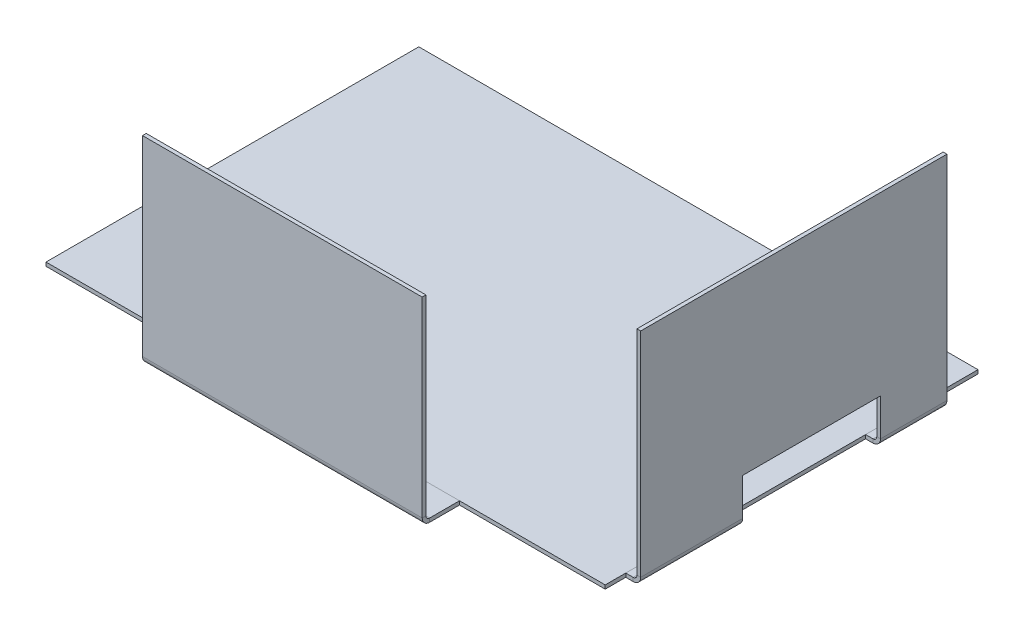
ISO-10303-21;
HEADER;
FILE_DESCRIPTION(('STEP AP214'),'2;1');
FILE_NAME('part.step','',(''),(''),'','','');
FILE_SCHEMA(('AUTOMOTIVE_DESIGN { 1 0 10303 214 1 1 1 1 }'));
ENDSEC;
DATA;
#1=APPLICATION_CONTEXT('core data for automotive mechanical design processes');
#2=APPLICATION_PROTOCOL_DEFINITION('international standard','automotive_design',2000,#1);
#3=PRODUCT_CONTEXT('',#1,'mechanical');
#4=PRODUCT('Part','Part','',(#3));
#5=PRODUCT_RELATED_PRODUCT_CATEGORY('part','',(#4));
#6=PRODUCT_DEFINITION_FORMATION('','',#4);
#7=PRODUCT_DEFINITION_CONTEXT('part definition',#1,'design');
#8=PRODUCT_DEFINITION('design','',#6,#7);
#9=PRODUCT_DEFINITION_SHAPE('','',#8);
#10=(LENGTH_UNIT() NAMED_UNIT(*) SI_UNIT(.MILLI.,.METRE.));
#11=(NAMED_UNIT(*) PLANE_ANGLE_UNIT() SI_UNIT($,.RADIAN.));
#12=(NAMED_UNIT(*) SI_UNIT($,.STERADIAN.) SOLID_ANGLE_UNIT());
#13=UNCERTAINTY_MEASURE_WITH_UNIT(LENGTH_MEASURE(1.E-05),#10,'distance_accuracy_value','');
#14=(GEOMETRIC_REPRESENTATION_CONTEXT(3) GLOBAL_UNCERTAINTY_ASSIGNED_CONTEXT((#13)) GLOBAL_UNIT_ASSIGNED_CONTEXT((#10,
#11,#12)) REPRESENTATION_CONTEXT('',''));
#15=CARTESIAN_POINT('',(0.,0.,0.));
#16=DIRECTION('',(0.,0.,1.));
#17=DIRECTION('',(1.,0.,0.));
#18=AXIS2_PLACEMENT_3D('',#15,#16,#17);
#19=CARTESIAN_POINT('',(-39.1111522381991,52.3221391573188,59.));
#20=DIRECTION('',(-1.,0.,0.));
#21=DIRECTION('',(0.,0.,1.));
#22=AXIS2_PLACEMENT_3D('',#19,#20,#21);
#23=PLANE('',#22);
#24=DIRECTION('',(0.,-1.,0.));
#25=VECTOR('',#24,1.);
#26=CARTESIAN_POINT('',(-39.1111522381991,52.3221391573188,59.));
#27=LINE('',#26,#25);
#28=CARTESIAN_POINT('',(-39.1111522381991,52.3221391573188,59.));
#29=VERTEX_POINT('',#28);
#30=CARTESIAN_POINT('',(-39.1111522381991,1.,59.));
#31=VERTEX_POINT('',#30);
#32=EDGE_CURVE('E141',#29,#31,#27,.T.);
#33=ORIENTED_EDGE('',*,*,#32,.T.);
#34=DIRECTION('',(0.,0.,1.));
#35=VECTOR('',#34,1.);
#36=CARTESIAN_POINT('',(-39.1111522381991,1.,59.));
#37=LINE('',#36,#35);
#38=CARTESIAN_POINT('',(-39.1111522381991,1.,60.));
#39=VERTEX_POINT('',#38);
#40=EDGE_CURVE('E132',#31,#39,#37,.T.);
#41=ORIENTED_EDGE('',*,*,#40,.T.);
#42=DIRECTION('',(0.,-1.,0.));
#43=VECTOR('',#42,1.);
#44=CARTESIAN_POINT('',(-39.1111522381991,52.3221391573188,60.));
#45=LINE('',#44,#43);
#46=CARTESIAN_POINT('',(-39.1111522381991,52.3221391573188,60.));
#47=VERTEX_POINT('',#46);
#48=EDGE_CURVE('E130',#47,#39,#45,.T.);
#49=ORIENTED_EDGE('',*,*,#48,.F.);
#50=DIRECTION('',(0.,0.,1.));
#51=VECTOR('',#50,1.);
#52=CARTESIAN_POINT('',(-39.1111522381991,52.3221391573188,59.));
#53=LINE('',#52,#51);
#54=EDGE_CURVE('E14',#29,#47,#53,.T.);
#55=ORIENTED_EDGE('',*,*,#54,.F.);
#56=EDGE_LOOP('',(#33,#41,#49,#55));
#57=FACE_BOUND('',#56,.T.);
#58=ADVANCED_FACE('F88',(#57),#23,.T.);
#59=CARTESIAN_POINT('',(0.,0.,59.));
#60=DIRECTION('',(0.,0.,1.));
#61=DIRECTION('',(1.,0.,0.));
#62=AXIS2_PLACEMENT_3D('',#59,#60,#61);
#63=PLANE('',#62);
#64=DIRECTION('',(-1.,0.,0.));
#65=VECTOR('',#64,1.);
#66=CARTESIAN_POINT('',(-39.1111522381991,1.,59.));
#67=LINE('',#66,#65);
#68=CARTESIAN_POINT('',(35.9143610931483,1.,59.));
#69=VERTEX_POINT('',#68);
#70=EDGE_CURVE('E154',#31,#69,#67,.F.);
#71=ORIENTED_EDGE('',*,*,#70,.F.);
#72=ORIENTED_EDGE('',*,*,#32,.F.);
#73=DIRECTION('',(-1.,0.,0.));
#74=VECTOR('',#73,1.);
#75=CARTESIAN_POINT('',(-39.1111522381991,52.3221391573188,59.));
#76=LINE('',#75,#74);
#77=CARTESIAN_POINT('',(35.9143610931483,52.3221391573188,59.));
#78=VERTEX_POINT('',#77);
#79=EDGE_CURVE('E127',#78,#29,#76,.T.);
#80=ORIENTED_EDGE('',*,*,#79,.F.);
#81=DIRECTION('',(0.,1.,0.));
#82=VECTOR('',#81,1.);
#83=CARTESIAN_POINT('',(35.9143610931483,52.3221391573188,59.));
#84=LINE('',#83,#82);
#85=EDGE_CURVE('E143',#69,#78,#84,.T.);
#86=ORIENTED_EDGE('',*,*,#85,.F.);
#87=EDGE_LOOP('',(#71,#72,#80,#86));
#88=FACE_BOUND('',#87,.T.);
#89=ADVANCED_FACE('F255',(#88),#63,.F.);
#90=CARTESIAN_POINT('',(0.,0.,60.));
#91=DIRECTION('',(0.,0.,1.));
#92=DIRECTION('',(1.,0.,0.));
#93=AXIS2_PLACEMENT_3D('',#90,#91,#92);
#94=PLANE('',#93);
#95=ORIENTED_EDGE('',*,*,#48,.T.);
#96=DIRECTION('',(-1.,0.,0.));
#97=VECTOR('',#96,1.);
#98=CARTESIAN_POINT('',(-39.1111522381991,1.,60.));
#99=LINE('',#98,#97);
#100=CARTESIAN_POINT('',(35.9143610931483,1.,60.));
#101=VERTEX_POINT('',#100);
#102=EDGE_CURVE('E164',#39,#101,#99,.F.);
#103=ORIENTED_EDGE('',*,*,#102,.T.);
#104=DIRECTION('',(0.,1.,0.));
#105=VECTOR('',#104,1.);
#106=CARTESIAN_POINT('',(35.9143610931483,52.3221391573188,60.));
#107=LINE('',#106,#105);
#108=CARTESIAN_POINT('',(35.9143610931483,52.3221391573188,60.));
#109=VERTEX_POINT('',#108);
#110=EDGE_CURVE('E135',#101,#109,#107,.T.);
#111=ORIENTED_EDGE('',*,*,#110,.T.);
#112=DIRECTION('',(-1.,0.,0.));
#113=VECTOR('',#112,1.);
#114=CARTESIAN_POINT('',(-39.1111522381991,52.3221391573188,60.));
#115=LINE('',#114,#113);
#116=EDGE_CURVE('E125',#109,#47,#115,.T.);
#117=ORIENTED_EDGE('',*,*,#116,.T.);
#118=EDGE_LOOP('',(#95,#103,#111,#117));
#119=FACE_BOUND('',#118,.T.);
#120=ADVANCED_FACE('F138',(#119),#94,.T.);
#121=CARTESIAN_POINT('',(-39.1111522381991,52.3221391573188,59.));
#122=DIRECTION('',(0.,1.,0.));
#123=DIRECTION('',(0.,0.,1.));
#124=AXIS2_PLACEMENT_3D('',#121,#122,#123);
#125=PLANE('',#124);
#126=ORIENTED_EDGE('',*,*,#116,.F.);
#127=DIRECTION('',(0.,0.,1.));
#128=VECTOR('',#127,1.);
#129=CARTESIAN_POINT('',(35.9143610931483,52.3221391573188,59.));
#130=LINE('',#129,#128);
#131=EDGE_CURVE('E91',#78,#109,#130,.T.);
#132=ORIENTED_EDGE('',*,*,#131,.F.);
#133=ORIENTED_EDGE('',*,*,#79,.T.);
#134=ORIENTED_EDGE('',*,*,#54,.T.);
#135=EDGE_LOOP('',(#126,#132,#133,#134));
#136=FACE_BOUND('',#135,.T.);
#137=ADVANCED_FACE('F122',(#136),#125,.T.);
#138=CARTESIAN_POINT('',(35.9143610931483,52.3221391573188,59.));
#139=DIRECTION('',(1.,0.,0.));
#140=DIRECTION('',(0.,0.,-1.));
#141=AXIS2_PLACEMENT_3D('',#138,#139,#140);
#142=PLANE('',#141);
#143=DIRECTION('',(0.,0.,1.));
#144=VECTOR('',#143,1.);
#145=CARTESIAN_POINT('',(35.9143610931483,1.,59.));
#146=LINE('',#145,#144);
#147=EDGE_CURVE('E136',#69,#101,#146,.T.);
#148=ORIENTED_EDGE('',*,*,#147,.F.);
#149=ORIENTED_EDGE('',*,*,#85,.T.);
#150=ORIENTED_EDGE('',*,*,#131,.T.);
#151=ORIENTED_EDGE('',*,*,#110,.F.);
#152=EDGE_LOOP('',(#148,#149,#150,#151));
#153=FACE_BOUND('',#152,.T.);
#154=ADVANCED_FACE('F253',(#153),#142,.T.);
#155=CARTESIAN_POINT('',(35.9143610931483,1.,58.));
#156=DIRECTION('',(1.,0.,0.));
#157=DIRECTION('',(0.,0.,-1.));
#158=AXIS2_PLACEMENT_3D('',#155,#156,#157);
#159=PLANE('',#158);
#160=DIRECTION('',(0.,-1.,0.));
#161=VECTOR('',#160,1.);
#162=CARTESIAN_POINT('',(35.9143610931483,0.,58.));
#163=LINE('',#162,#161);
#164=CARTESIAN_POINT('',(35.9143610931483,0.,58.));
#165=VERTEX_POINT('',#164);
#166=CARTESIAN_POINT('',(35.9143610931483,-0.999999999999999,58.));
#167=VERTEX_POINT('',#166);
#168=EDGE_CURVE('E193',#165,#167,#163,.T.);
#169=ORIENTED_EDGE('',*,*,#168,.F.);
#170=CARTESIAN_POINT('',(35.9143610931483,1.,58.));
#171=DIRECTION('',(-1.,0.,0.));
#172=DIRECTION('',(0.,0.,1.));
#173=AXIS2_PLACEMENT_3D('',#170,#171,#172);
#174=CIRCLE('',#173,0.999999999999999);
#175=EDGE_CURVE('E158',#69,#165,#174,.F.);
#176=ORIENTED_EDGE('',*,*,#175,.F.);
#177=ORIENTED_EDGE('',*,*,#147,.T.);
#178=CARTESIAN_POINT('',(35.9143610931483,1.,58.));
#179=DIRECTION('',(-1.,0.,0.));
#180=DIRECTION('',(0.,0.,1.));
#181=AXIS2_PLACEMENT_3D('',#178,#179,#180);
#182=CIRCLE('',#181,2.);
#183=EDGE_CURVE('E102',#101,#167,#182,.F.);
#184=ORIENTED_EDGE('',*,*,#183,.T.);
#185=EDGE_LOOP('',(#169,#176,#177,#184));
#186=FACE_BOUND('',#185,.T.);
#187=ADVANCED_FACE('F249',(#186),#159,.T.);
#188=CARTESIAN_POINT('',(-39.1111522381991,1.,58.));
#189=DIRECTION('',(1.,0.,0.));
#190=DIRECTION('',(0.,0.,-1.));
#191=AXIS2_PLACEMENT_3D('',#188,#189,#190);
#192=PLANE('',#191);
#193=CARTESIAN_POINT('',(-39.1111522381991,1.,58.));
#194=DIRECTION('',(-1.,0.,0.));
#195=DIRECTION('',(0.,0.,1.));
#196=AXIS2_PLACEMENT_3D('',#193,#194,#195);
#197=CIRCLE('',#196,0.999999999999999);
#198=CARTESIAN_POINT('',(-39.1111522381991,0.,58.));
#199=VERTEX_POINT('',#198);
#200=EDGE_CURVE('E151',#199,#31,#197,.T.);
#201=ORIENTED_EDGE('',*,*,#200,.F.);
#202=DIRECTION('',(0.,-1.,0.));
#203=VECTOR('',#202,1.);
#204=CARTESIAN_POINT('',(-39.1111522381991,0.,58.));
#205=LINE('',#204,#203);
#206=CARTESIAN_POINT('',(-39.1111522381991,-0.999999999999999,58.));
#207=VERTEX_POINT('',#206);
#208=EDGE_CURVE('E192',#199,#207,#205,.T.);
#209=ORIENTED_EDGE('',*,*,#208,.T.);
#210=CARTESIAN_POINT('',(-39.1111522381991,1.,58.));
#211=DIRECTION('',(-1.,0.,0.));
#212=DIRECTION('',(0.,0.,1.));
#213=AXIS2_PLACEMENT_3D('',#210,#211,#212);
#214=CIRCLE('',#213,2.);
#215=EDGE_CURVE('E161',#207,#39,#214,.T.);
#216=ORIENTED_EDGE('',*,*,#215,.T.);
#217=ORIENTED_EDGE('',*,*,#40,.F.);
#218=EDGE_LOOP('',(#201,#209,#216,#217));
#219=FACE_BOUND('',#218,.T.);
#220=ADVANCED_FACE('F214',(#219),#192,.F.);
#221=CARTESIAN_POINT('',(-39.1111522381991,1.,58.));
#222=DIRECTION('',(-1.,0.,0.));
#223=DIRECTION('',(0.,-1.,0.));
#224=AXIS2_PLACEMENT_3D('',#221,#222,#223);
#225=CYLINDRICAL_SURFACE('',#224,2.);
#226=ORIENTED_EDGE('',*,*,#102,.F.);
#227=ORIENTED_EDGE('',*,*,#215,.F.);
#228=DIRECTION('',(1.,0.,0.));
#229=VECTOR('',#228,1.);
#230=CARTESIAN_POINT('',(0.,-0.999999999999999,58.));
#231=LINE('',#230,#229);
#232=EDGE_CURVE('E183',#207,#167,#231,.T.);
#233=ORIENTED_EDGE('',*,*,#232,.T.);
#234=ORIENTED_EDGE('',*,*,#183,.F.);
#235=EDGE_LOOP('',(#226,#227,#233,#234));
#236=FACE_BOUND('',#235,.T.);
#237=ADVANCED_FACE('F274',(#236),#225,.T.);
#238=CARTESIAN_POINT('',(-39.1111522381991,1.,58.));
#239=DIRECTION('',(-1.,0.,0.));
#240=DIRECTION('',(0.,-1.,0.));
#241=AXIS2_PLACEMENT_3D('',#238,#239,#240);
#242=CYLINDRICAL_SURFACE('',#241,0.999999999999999);
#243=ORIENTED_EDGE('',*,*,#70,.T.);
#244=ORIENTED_EDGE('',*,*,#175,.T.);
#245=DIRECTION('',(-1.,0.,0.));
#246=VECTOR('',#245,1.);
#247=CARTESIAN_POINT('',(35.9143610931483,0.,58.));
#248=LINE('',#247,#246);
#249=EDGE_CURVE('E196',#165,#199,#248,.T.);
#250=ORIENTED_EDGE('',*,*,#249,.T.);
#251=ORIENTED_EDGE('',*,*,#200,.T.);
#252=EDGE_LOOP('',(#243,#244,#250,#251));
#253=FACE_BOUND('',#252,.T.);
#254=ADVANCED_FACE('F204',(#253),#242,.F.);
#255=CARTESIAN_POINT('',(-39.1111522381991,-1.00000000000003,50.));
#256=DIRECTION('',(1.,0.,0.));
#257=DIRECTION('',(0.,0.,-1.));
#258=AXIS2_PLACEMENT_3D('',#255,#256,#257);
#259=PLANE('',#258);
#260=ORIENTED_EDGE('',*,*,#208,.F.);
#261=DIRECTION('',(0.,0.,-1.));
#262=VECTOR('',#261,1.);
#263=CARTESIAN_POINT('',(-39.1111522381991,0.,50.));
#264=LINE('',#263,#262);
#265=CARTESIAN_POINT('',(-39.1111522381991,0.,50.));
#266=VERTEX_POINT('',#265);
#267=EDGE_CURVE('E180',#199,#266,#264,.T.);
#268=ORIENTED_EDGE('',*,*,#267,.T.);
#269=DIRECTION('',(0.,1.,0.));
#270=VECTOR('',#269,1.);
#271=CARTESIAN_POINT('',(-39.1111522381991,-1.00000000000003,50.));
#272=LINE('',#271,#270);
#273=CARTESIAN_POINT('',(-39.1111522381991,-1.00000000000003,50.));
#274=VERTEX_POINT('',#273);
#275=EDGE_CURVE('E155',#274,#266,#272,.T.);
#276=ORIENTED_EDGE('',*,*,#275,.F.);
#277=DIRECTION('',(0.,0.,-1.));
#278=VECTOR('',#277,1.);
#279=CARTESIAN_POINT('',(-39.1111522381991,-1.00000000000003,50.));
#280=LINE('',#279,#278);
#281=EDGE_CURVE('E176',#207,#274,#280,.T.);
#282=ORIENTED_EDGE('',*,*,#281,.F.);
#283=EDGE_LOOP('',(#260,#268,#276,#282));
#284=FACE_BOUND('',#283,.T.);
#285=ADVANCED_FACE('F219',(#284),#259,.F.);
#286=CARTESIAN_POINT('',(35.9143610931483,-0.999999999999995,59.));
#287=DIRECTION('',(-1.,0.,0.));
#288=DIRECTION('',(0.,0.,1.));
#289=AXIS2_PLACEMENT_3D('',#286,#287,#288);
#290=PLANE('',#289);
#291=ORIENTED_EDGE('',*,*,#168,.T.);
#292=DIRECTION('',(0.,0.,1.));
#293=VECTOR('',#292,1.);
#294=CARTESIAN_POINT('',(35.9143610931483,-0.999999999999995,59.));
#295=LINE('',#294,#293);
#296=CARTESIAN_POINT('',(35.9143610931483,-1.00000000000003,50.));
#297=VERTEX_POINT('',#296);
#298=EDGE_CURVE('E172',#297,#167,#295,.T.);
#299=ORIENTED_EDGE('',*,*,#298,.F.);
#300=DIRECTION('',(0.,1.,0.));
#301=VECTOR('',#300,1.);
#302=CARTESIAN_POINT('',(35.9143610931483,-1.00000000000003,50.));
#303=LINE('',#302,#301);
#304=CARTESIAN_POINT('',(35.9143610931483,0.,50.));
#305=VERTEX_POINT('',#304);
#306=EDGE_CURVE('E169',#297,#305,#303,.T.);
#307=ORIENTED_EDGE('',*,*,#306,.T.);
#308=DIRECTION('',(0.,0.,1.));
#309=VECTOR('',#308,1.);
#310=CARTESIAN_POINT('',(35.9143610931483,0.,59.));
#311=LINE('',#310,#309);
#312=EDGE_CURVE('E173',#305,#165,#311,.T.);
#313=ORIENTED_EDGE('',*,*,#312,.T.);
#314=EDGE_LOOP('',(#291,#299,#307,#313));
#315=FACE_BOUND('',#314,.T.);
#316=ADVANCED_FACE('F235',(#315),#290,.F.);
#317=CARTESIAN_POINT('',(0.,-1.0000000000002,0.));
#318=DIRECTION('',(0.,1.,0.));
#319=DIRECTION('',(0.,0.,1.));
#320=AXIS2_PLACEMENT_3D('',#317,#318,#319);
#321=PLANE('',#320);
#322=ORIENTED_EDGE('',*,*,#232,.F.);
#323=ORIENTED_EDGE('',*,*,#281,.T.);
#324=DIRECTION('',(1.,0.,0.));
#325=VECTOR('',#324,1.);
#326=CARTESIAN_POINT('',(35.9143610931483,-1.00000000000003,50.));
#327=LINE('',#326,#325);
#328=EDGE_CURVE('E186',#274,#297,#327,.T.);
#329=ORIENTED_EDGE('',*,*,#328,.T.);
#330=ORIENTED_EDGE('',*,*,#298,.T.);
#331=EDGE_LOOP('',(#322,#323,#329,#330));
#332=FACE_BOUND('',#331,.T.);
#333=ADVANCED_FACE('F240',(#332),#321,.F.);
#334=CARTESIAN_POINT('',(0.,-2.01226909432809E-13,0.));
#335=DIRECTION('',(0.,1.,0.));
#336=DIRECTION('',(0.,0.,1.));
#337=AXIS2_PLACEMENT_3D('',#334,#335,#336);
#338=PLANE('',#337);
#339=ORIENTED_EDGE('',*,*,#267,.F.);
#340=ORIENTED_EDGE('',*,*,#249,.F.);
#341=ORIENTED_EDGE('',*,*,#312,.F.);
#342=DIRECTION('',(1.,0.,0.));
#343=VECTOR('',#342,1.);
#344=CARTESIAN_POINT('',(35.9143610931483,0.,50.));
#345=LINE('',#344,#343);
#346=EDGE_CURVE('E177',#266,#305,#345,.T.);
#347=ORIENTED_EDGE('',*,*,#346,.F.);
#348=EDGE_LOOP('',(#339,#340,#341,#347));
#349=FACE_BOUND('',#348,.T.);
#350=ADVANCED_FACE('F223',(#349),#338,.T.);
#351=CARTESIAN_POINT('',(35.9143610931483,-1.00000000000003,50.));
#352=DIRECTION('',(0.,0.,1.));
#353=DIRECTION('',(0.,-1.,0.));
#354=AXIS2_PLACEMENT_3D('',#351,#352,#353);
#355=PLANE('',#354);
#356=ORIENTED_EDGE('',*,*,#346,.T.);
#357=ORIENTED_EDGE('',*,*,#306,.F.);
#358=ORIENTED_EDGE('',*,*,#328,.F.);
#359=ORIENTED_EDGE('',*,*,#275,.T.);
#360=EDGE_LOOP('',(#356,#357,#358,#359));
#361=FACE_BOUND('',#360,.T.);
#362=ADVANCED_FACE('F228',(#361),#355,.F.);
#363=CLOSED_SHELL('',(#58,#89,#120,#137,#154,#187,#220,#237,#254,#285,#316,#333,#350,#362));
#364=MANIFOLD_SOLID_BREP('B2',#363);
#365=CARTESIAN_POINT('',(78.,10.9986856522136,-19.8482134290394));
#366=DIRECTION('',(0.,0.,-1.));
#367=DIRECTION('',(0.,-1.,0.));
#368=AXIS2_PLACEMENT_3D('',#365,#366,#367);
#369=PLANE('',#368);
#370=DIRECTION('',(-1.,0.,0.));
#371=VECTOR('',#370,1.);
#372=CARTESIAN_POINT('',(78.,1.,-19.8482134290394));
#373=LINE('',#372,#371);
#374=CARTESIAN_POINT('',(79.,1.,-19.8482134290394));
#375=VERTEX_POINT('',#374);
#376=CARTESIAN_POINT('',(78.,1.,-19.8482134290394));
#377=VERTEX_POINT('',#376);
#378=EDGE_CURVE('E419',#375,#377,#373,.T.);
#379=ORIENTED_EDGE('',*,*,#378,.F.);
#380=DIRECTION('',(0.,1.,0.));
#381=VECTOR('',#380,1.);
#382=CARTESIAN_POINT('',(79.,0.,-19.8482134290394));
#383=LINE('',#382,#381);
#384=CARTESIAN_POINT('',(79.,10.9986856522136,-19.8482134290394));
#385=VERTEX_POINT('',#384);
#386=EDGE_CURVE('E495',#385,#375,#383,.F.);
#387=ORIENTED_EDGE('',*,*,#386,.F.);
#388=DIRECTION('',(-1.,0.,0.));
#389=VECTOR('',#388,1.);
#390=CARTESIAN_POINT('',(78.,10.9986856522136,-19.8482134290394));
#391=LINE('',#390,#389);
#392=CARTESIAN_POINT('',(78.,10.9986856522136,-19.8482134290394));
#393=VERTEX_POINT('',#392);
#394=EDGE_CURVE('E489',#385,#393,#391,.T.);
#395=ORIENTED_EDGE('',*,*,#394,.T.);
#396=DIRECTION('',(0.,-1.,0.));
#397=VECTOR('',#396,1.);
#398=CARTESIAN_POINT('',(78.,10.9986856522136,-19.8482134290394));
#399=LINE('',#398,#397);
#400=EDGE_CURVE('E493',#393,#377,#399,.T.);
#401=ORIENTED_EDGE('',*,*,#400,.T.);
#402=EDGE_LOOP('',(#379,#387,#395,#401));
#403=FACE_BOUND('',#402,.T.);
#404=ADVANCED_FACE('F409',(#403),#369,.F.);
#405=CARTESIAN_POINT('',(78.,10.9986856522136,17.1097125478177));
#406=DIRECTION('',(0.,1.,0.));
#407=DIRECTION('',(0.,0.,-1.));
#408=AXIS2_PLACEMENT_3D('',#405,#406,#407);
#409=PLANE('',#408);
#410=ORIENTED_EDGE('',*,*,#394,.F.);
#411=DIRECTION('',(0.,0.,1.));
#412=VECTOR('',#411,1.);
#413=CARTESIAN_POINT('',(79.,10.9986856522136,0.));
#414=LINE('',#413,#412);
#415=CARTESIAN_POINT('',(79.,10.9986856522136,17.1097125478177));
#416=VERTEX_POINT('',#415);
#417=EDGE_CURVE('E537',#416,#385,#414,.F.);
#418=ORIENTED_EDGE('',*,*,#417,.F.);
#419=DIRECTION('',(-1.,0.,0.));
#420=VECTOR('',#419,1.);
#421=CARTESIAN_POINT('',(78.,10.9986856522136,17.1097125478177));
#422=LINE('',#421,#420);
#423=CARTESIAN_POINT('',(78.,10.9986856522136,17.1097125478177));
#424=VERTEX_POINT('',#423);
#425=EDGE_CURVE('E500',#416,#424,#422,.T.);
#426=ORIENTED_EDGE('',*,*,#425,.T.);
#427=DIRECTION('',(0.,0.,-1.));
#428=VECTOR('',#427,1.);
#429=CARTESIAN_POINT('',(78.,10.9986856522136,17.1097125478177));
#430=LINE('',#429,#428);
#431=EDGE_CURVE('E508',#424,#393,#430,.T.);
#432=ORIENTED_EDGE('',*,*,#431,.T.);
#433=EDGE_LOOP('',(#410,#418,#426,#432));
#434=FACE_BOUND('',#433,.T.);
#435=ADVANCED_FACE('F514',(#434),#409,.F.);
#436=CARTESIAN_POINT('',(78.,1.,17.1097125478177));
#437=DIRECTION('',(0.,0.,1.));
#438=DIRECTION('',(0.,1.,0.));
#439=AXIS2_PLACEMENT_3D('',#436,#437,#438);
#440=PLANE('',#439);
#441=ORIENTED_EDGE('',*,*,#425,.F.);
#442=DIRECTION('',(0.,1.,0.));
#443=VECTOR('',#442,1.);
#444=CARTESIAN_POINT('',(79.,0.,17.1097125478177));
#445=LINE('',#444,#443);
#446=CARTESIAN_POINT('',(79.,1.,17.1097125478177));
#447=VERTEX_POINT('',#446);
#448=EDGE_CURVE('E534',#447,#416,#445,.T.);
#449=ORIENTED_EDGE('',*,*,#448,.F.);
#450=DIRECTION('',(-1.,0.,0.));
#451=VECTOR('',#450,1.);
#452=CARTESIAN_POINT('',(78.,1.,17.1097125478177));
#453=LINE('',#452,#451);
#454=CARTESIAN_POINT('',(78.,1.,17.1097125478177));
#455=VERTEX_POINT('',#454);
#456=EDGE_CURVE('E547',#447,#455,#453,.T.);
#457=ORIENTED_EDGE('',*,*,#456,.T.);
#458=DIRECTION('',(0.,1.,0.));
#459=VECTOR('',#458,1.);
#460=CARTESIAN_POINT('',(78.,1.,17.1097125478177));
#461=LINE('',#460,#459);
#462=EDGE_CURVE('E515',#455,#424,#461,.T.);
#463=ORIENTED_EDGE('',*,*,#462,.T.);
#464=EDGE_LOOP('',(#441,#449,#457,#463));
#465=FACE_BOUND('',#464,.T.);
#466=ADVANCED_FACE('F683',(#465),#440,.F.);
#467=CARTESIAN_POINT('',(78.,58.2335739107928,44.4859608868171));
#468=DIRECTION('',(0.,0.,-1.));
#469=DIRECTION('',(0.,-1.,0.));
#470=AXIS2_PLACEMENT_3D('',#467,#468,#469);
#471=PLANE('',#470);
#472=DIRECTION('',(-1.,0.,0.));
#473=VECTOR('',#472,1.);
#474=CARTESIAN_POINT('',(78.,1.,44.4859608868171));
#475=LINE('',#474,#473);
#476=CARTESIAN_POINT('',(79.,1.,44.4859608868171));
#477=VERTEX_POINT('',#476);
#478=CARTESIAN_POINT('',(78.,1.,44.4859608868171));
#479=VERTEX_POINT('',#478);
#480=EDGE_CURVE('E545',#477,#479,#475,.T.);
#481=ORIENTED_EDGE('',*,*,#480,.F.);
#482=DIRECTION('',(0.,1.,0.));
#483=VECTOR('',#482,1.);
#484=CARTESIAN_POINT('',(79.,0.,44.4859608868171));
#485=LINE('',#484,#483);
#486=CARTESIAN_POINT('',(79.,58.2335739107928,44.4859608868171));
#487=VERTEX_POINT('',#486);
#488=EDGE_CURVE('E529',#487,#477,#485,.F.);
#489=ORIENTED_EDGE('',*,*,#488,.F.);
#490=DIRECTION('',(-1.,0.,0.));
#491=VECTOR('',#490,1.);
#492=CARTESIAN_POINT('',(78.,58.2335739107928,44.4859608868171));
#493=LINE('',#492,#491);
#494=CARTESIAN_POINT('',(78.,58.2335739107928,44.4859608868171));
#495=VERTEX_POINT('',#494);
#496=EDGE_CURVE('E427',#487,#495,#493,.T.);
#497=ORIENTED_EDGE('',*,*,#496,.T.);
#498=DIRECTION('',(0.,-1.,0.));
#499=VECTOR('',#498,1.);
#500=CARTESIAN_POINT('',(78.,58.2335739107928,44.4859608868171));
#501=LINE('',#500,#499);
#502=EDGE_CURVE('E522',#495,#479,#501,.T.);
#503=ORIENTED_EDGE('',*,*,#502,.T.);
#504=EDGE_LOOP('',(#481,#489,#497,#503));
#505=FACE_BOUND('',#504,.T.);
#506=ADVANCED_FACE('F687',(#505),#471,.F.);
#507=CARTESIAN_POINT('',(78.,58.2335739107928,44.4859608868171));
#508=DIRECTION('',(0.,1.,0.));
#509=DIRECTION('',(0.,0.,-1.));
#510=AXIS2_PLACEMENT_3D('',#507,#508,#509);
#511=PLANE('',#510);
#512=ORIENTED_EDGE('',*,*,#496,.F.);
#513=DIRECTION('',(0.,0.,1.));
#514=VECTOR('',#513,1.);
#515=CARTESIAN_POINT('',(79.,58.2335739107928,0.));
#516=LINE('',#515,#514);
#517=CARTESIAN_POINT('',(79.,58.2335739107928,-37.6507989938659));
#518=VERTEX_POINT('',#517);
#519=EDGE_CURVE('E524',#487,#518,#516,.F.);
#520=ORIENTED_EDGE('',*,*,#519,.T.);
#521=DIRECTION('',(-1.,0.,0.));
#522=VECTOR('',#521,1.);
#523=CARTESIAN_POINT('',(78.,58.2335739107928,-37.6507989938659));
#524=LINE('',#523,#522);
#525=CARTESIAN_POINT('',(78.,58.2335739107928,-37.6507989938659));
#526=VERTEX_POINT('',#525);
#527=EDGE_CURVE('E413',#518,#526,#524,.T.);
#528=ORIENTED_EDGE('',*,*,#527,.T.);
#529=DIRECTION('',(0.,0.,-1.));
#530=VECTOR('',#529,1.);
#531=CARTESIAN_POINT('',(78.,58.2335739107928,44.4859608868171));
#532=LINE('',#531,#530);
#533=EDGE_CURVE('E532',#495,#526,#532,.T.);
#534=ORIENTED_EDGE('',*,*,#533,.F.);
#535=EDGE_LOOP('',(#512,#520,#528,#534));
#536=FACE_BOUND('',#535,.T.);
#537=ADVANCED_FACE('F711',(#536),#511,.T.);
#538=CARTESIAN_POINT('',(78.,58.2335739107928,-37.6507989938659));
#539=DIRECTION('',(0.,0.,-1.));
#540=DIRECTION('',(0.,-1.,0.));
#541=AXIS2_PLACEMENT_3D('',#538,#539,#540);
#542=PLANE('',#541);
#543=DIRECTION('',(0.,1.,0.));
#544=VECTOR('',#543,1.);
#545=CARTESIAN_POINT('',(79.,0.,-37.6507989938659));
#546=LINE('',#545,#544);
#547=CARTESIAN_POINT('',(79.,1.,-37.6507989938659));
#548=VERTEX_POINT('',#547);
#549=EDGE_CURVE('E527',#518,#548,#546,.F.);
#550=ORIENTED_EDGE('',*,*,#549,.T.);
#551=DIRECTION('',(-1.,0.,0.));
#552=VECTOR('',#551,1.);
#553=CARTESIAN_POINT('',(78.,1.,-37.6507989938659));
#554=LINE('',#553,#552);
#555=CARTESIAN_POINT('',(78.,1.,-37.6507989938659));
#556=VERTEX_POINT('',#555);
#557=EDGE_CURVE('E86',#548,#556,#554,.T.);
#558=ORIENTED_EDGE('',*,*,#557,.T.);
#559=DIRECTION('',(0.,-1.,0.));
#560=VECTOR('',#559,1.);
#561=CARTESIAN_POINT('',(78.,58.2335739107928,-37.6507989938659));
#562=LINE('',#561,#560);
#563=EDGE_CURVE('E627',#526,#556,#562,.T.);
#564=ORIENTED_EDGE('',*,*,#563,.F.);
#565=ORIENTED_EDGE('',*,*,#527,.F.);
#566=EDGE_LOOP('',(#550,#558,#564,#565));
#567=FACE_BOUND('',#566,.T.);
#568=ADVANCED_FACE('F411',(#567),#542,.T.);
#569=CARTESIAN_POINT('',(78.,0.,0.));
#570=DIRECTION('',(-1.,0.,0.));
#571=DIRECTION('',(0.,0.,1.));
#572=AXIS2_PLACEMENT_3D('',#569,#570,#571);
#573=PLANE('',#572);
#574=ORIENTED_EDGE('',*,*,#533,.T.);
#575=ORIENTED_EDGE('',*,*,#563,.T.);
#576=DIRECTION('',(0.,0.,-1.));
#577=VECTOR('',#576,1.);
#578=CARTESIAN_POINT('',(78.,1.,-19.8482134290394));
#579=LINE('',#578,#577);
#580=EDGE_CURVE('E512',#377,#556,#579,.T.);
#581=ORIENTED_EDGE('',*,*,#580,.F.);
#582=ORIENTED_EDGE('',*,*,#400,.F.);
#583=ORIENTED_EDGE('',*,*,#431,.F.);
#584=ORIENTED_EDGE('',*,*,#462,.F.);
#585=DIRECTION('',(0.,0.,-1.));
#586=VECTOR('',#585,1.);
#587=CARTESIAN_POINT('',(78.,1.,44.4859608868171));
#588=LINE('',#587,#586);
#589=EDGE_CURVE('E517',#479,#455,#588,.T.);
#590=ORIENTED_EDGE('',*,*,#589,.F.);
#591=ORIENTED_EDGE('',*,*,#502,.F.);
#592=EDGE_LOOP('',(#574,#575,#581,#582,#583,#584,#590,#591));
#593=FACE_BOUND('',#592,.T.);
#594=ADVANCED_FACE('F506',(#593),#573,.T.);
#595=CARTESIAN_POINT('',(79.,0.,0.));
#596=DIRECTION('',(-1.,0.,0.));
#597=DIRECTION('',(0.,0.,1.));
#598=AXIS2_PLACEMENT_3D('',#595,#596,#597);
#599=PLANE('',#598);
#600=ORIENTED_EDGE('',*,*,#519,.F.);
#601=ORIENTED_EDGE('',*,*,#488,.T.);
#602=DIRECTION('',(0.,0.,1.));
#603=VECTOR('',#602,1.);
#604=CARTESIAN_POINT('',(79.,1.,0.));
#605=LINE('',#604,#603);
#606=EDGE_CURVE('E466',#477,#447,#605,.F.);
#607=ORIENTED_EDGE('',*,*,#606,.T.);
#608=ORIENTED_EDGE('',*,*,#448,.T.);
#609=ORIENTED_EDGE('',*,*,#417,.T.);
#610=ORIENTED_EDGE('',*,*,#386,.T.);
#611=DIRECTION('',(0.,0.,1.));
#612=VECTOR('',#611,1.);
#613=CARTESIAN_POINT('',(79.,1.,0.));
#614=LINE('',#613,#612);
#615=EDGE_CURVE('E540',#375,#548,#614,.F.);
#616=ORIENTED_EDGE('',*,*,#615,.T.);
#617=ORIENTED_EDGE('',*,*,#549,.F.);
#618=EDGE_LOOP('',(#600,#601,#607,#608,#609,#610,#616,#617));
#619=FACE_BOUND('',#618,.T.);
#620=ADVANCED_FACE('F637',(#619),#599,.F.);
#621=CARTESIAN_POINT('',(77.,1.,17.1097125478177));
#622=DIRECTION('',(0.,0.,-1.));
#623=DIRECTION('',(-1.,0.,0.));
#624=AXIS2_PLACEMENT_3D('',#621,#622,#623);
#625=PLANE('',#624);
#626=DIRECTION('',(0.,1.,0.));
#627=VECTOR('',#626,1.);
#628=CARTESIAN_POINT('',(77.,-0.999999999999997,17.1097125478177));
#629=LINE('',#628,#627);
#630=CARTESIAN_POINT('',(77.,0.,17.1097125478177));
#631=VERTEX_POINT('',#630);
#632=CARTESIAN_POINT('',(77.,-0.999999999999994,17.1097125478177));
#633=VERTEX_POINT('',#632);
#634=EDGE_CURVE('E614',#631,#633,#629,.F.);
#635=ORIENTED_EDGE('',*,*,#634,.F.);
#636=CARTESIAN_POINT('',(77.,1.,17.1097125478177));
#637=DIRECTION('',(0.,0.,1.));
#638=DIRECTION('',(1.,0.,0.));
#639=AXIS2_PLACEMENT_3D('',#636,#637,#638);
#640=CIRCLE('',#639,0.999999999999997);
#641=EDGE_CURVE('E621',#455,#631,#640,.F.);
#642=ORIENTED_EDGE('',*,*,#641,.F.);
#643=ORIENTED_EDGE('',*,*,#456,.F.);
#644=CARTESIAN_POINT('',(77.,1.,17.1097125478177));
#645=DIRECTION('',(0.,0.,1.));
#646=DIRECTION('',(1.,0.,0.));
#647=AXIS2_PLACEMENT_3D('',#644,#645,#646);
#648=CIRCLE('',#647,2.);
#649=EDGE_CURVE('E528',#447,#633,#648,.F.);
#650=ORIENTED_EDGE('',*,*,#649,.T.);
#651=EDGE_LOOP('',(#635,#642,#643,#650));
#652=FACE_BOUND('',#651,.T.);
#653=ADVANCED_FACE('F679',(#652),#625,.T.);
#654=CARTESIAN_POINT('',(77.,1.,44.4859608868171));
#655=DIRECTION('',(0.,0.,-1.));
#656=DIRECTION('',(-1.,0.,0.));
#657=AXIS2_PLACEMENT_3D('',#654,#655,#656);
#658=PLANE('',#657);
#659=CARTESIAN_POINT('',(77.,1.,44.4859608868171));
#660=DIRECTION('',(0.,0.,1.));
#661=DIRECTION('',(1.,0.,0.));
#662=AXIS2_PLACEMENT_3D('',#659,#660,#661);
#663=CIRCLE('',#662,0.999999999999997);
#664=CARTESIAN_POINT('',(77.,0.,44.4859608868171));
#665=VERTEX_POINT('',#664);
#666=EDGE_CURVE('E585',#665,#479,#663,.T.);
#667=ORIENTED_EDGE('',*,*,#666,.F.);
#668=DIRECTION('',(0.,1.,0.));
#669=VECTOR('',#668,1.);
#670=CARTESIAN_POINT('',(77.,0.,44.4859608868171));
#671=LINE('',#670,#669);
#672=CARTESIAN_POINT('',(77.,-0.999999999999997,44.4859608868171));
#673=VERTEX_POINT('',#672);
#674=EDGE_CURVE('E609',#665,#673,#671,.F.);
#675=ORIENTED_EDGE('',*,*,#674,.T.);
#676=CARTESIAN_POINT('',(77.,1.,44.4859608868171));
#677=DIRECTION('',(0.,0.,1.));
#678=DIRECTION('',(1.,0.,0.));
#679=AXIS2_PLACEMENT_3D('',#676,#677,#678);
#680=CIRCLE('',#679,2.);
#681=EDGE_CURVE('E619',#673,#477,#680,.T.);
#682=ORIENTED_EDGE('',*,*,#681,.T.);
#683=ORIENTED_EDGE('',*,*,#480,.T.);
#684=EDGE_LOOP('',(#667,#675,#682,#683));
#685=FACE_BOUND('',#684,.T.);
#686=ADVANCED_FACE('F690',(#685),#658,.F.);
#687=CARTESIAN_POINT('',(77.,1.,44.4859608868171));
#688=DIRECTION('',(0.,0.,1.));
#689=DIRECTION('',(0.,-1.,0.));
#690=AXIS2_PLACEMENT_3D('',#687,#688,#689);
#691=CYLINDRICAL_SURFACE('',#690,2.);
#692=ORIENTED_EDGE('',*,*,#606,.F.);
#693=ORIENTED_EDGE('',*,*,#681,.F.);
#694=DIRECTION('',(0.,0.,1.));
#695=VECTOR('',#694,1.);
#696=CARTESIAN_POINT('',(77.,-0.999999999999997,17.1097125478177));
#697=LINE('',#696,#695);
#698=EDGE_CURVE('E607',#673,#633,#697,.F.);
#699=ORIENTED_EDGE('',*,*,#698,.T.);
#700=ORIENTED_EDGE('',*,*,#649,.F.);
#701=EDGE_LOOP('',(#692,#693,#699,#700));
#702=FACE_BOUND('',#701,.T.);
#703=ADVANCED_FACE('F676',(#702),#691,.T.);
#704=CARTESIAN_POINT('',(77.,1.,44.4859608868171));
#705=DIRECTION('',(0.,0.,1.));
#706=DIRECTION('',(0.,-1.,0.));
#707=AXIS2_PLACEMENT_3D('',#704,#705,#706);
#708=CYLINDRICAL_SURFACE('',#707,0.999999999999997);
#709=ORIENTED_EDGE('',*,*,#589,.T.);
#710=ORIENTED_EDGE('',*,*,#641,.T.);
#711=DIRECTION('',(0.,0.,1.));
#712=VECTOR('',#711,1.);
#713=CARTESIAN_POINT('',(77.,0.,17.1097125478177));
#714=LINE('',#713,#712);
#715=EDGE_CURVE('E612',#631,#665,#714,.T.);
#716=ORIENTED_EDGE('',*,*,#715,.T.);
#717=ORIENTED_EDGE('',*,*,#666,.T.);
#718=EDGE_LOOP('',(#709,#710,#716,#717));
#719=FACE_BOUND('',#718,.T.);
#720=ADVANCED_FACE('F691',(#719),#708,.F.);
#721=CARTESIAN_POINT('',(75.,-1.00000000000001,44.4859608868171));
#722=DIRECTION('',(0.,0.,-1.));
#723=DIRECTION('',(-1.,0.,0.));
#724=AXIS2_PLACEMENT_3D('',#721,#722,#723);
#725=PLANE('',#724);
#726=ORIENTED_EDGE('',*,*,#674,.F.);
#727=DIRECTION('',(1.,0.,0.));
#728=VECTOR('',#727,1.);
#729=CARTESIAN_POINT('',(75.,0.,44.4859608868171));
#730=LINE('',#729,#728);
#731=CARTESIAN_POINT('',(75.,0.,44.4859608868171));
#732=VERTEX_POINT('',#731);
#733=EDGE_CURVE('E604',#665,#732,#730,.F.);
#734=ORIENTED_EDGE('',*,*,#733,.T.);
#735=DIRECTION('',(0.,1.,0.));
#736=VECTOR('',#735,1.);
#737=CARTESIAN_POINT('',(75.,-1.00000000000001,44.4859608868171));
#738=LINE('',#737,#736);
#739=CARTESIAN_POINT('',(75.,-1.00000000000001,44.4859608868171));
#740=VERTEX_POINT('',#739);
#741=EDGE_CURVE('E582',#740,#732,#738,.T.);
#742=ORIENTED_EDGE('',*,*,#741,.F.);
#743=DIRECTION('',(-1.,0.,0.));
#744=VECTOR('',#743,1.);
#745=CARTESIAN_POINT('',(0.,-1.00000000000054,44.4859608868171));
#746=LINE('',#745,#744);
#747=EDGE_CURVE('E595',#673,#740,#746,.T.);
#748=ORIENTED_EDGE('',*,*,#747,.F.);
#749=EDGE_LOOP('',(#726,#734,#742,#748));
#750=FACE_BOUND('',#749,.T.);
#751=ADVANCED_FACE('F659',(#750),#725,.F.);
#752=CARTESIAN_POINT('',(78.,-0.99999999999999,17.1097125478177));
#753=DIRECTION('',(0.,0.,1.));
#754=DIRECTION('',(1.,0.,0.));
#755=AXIS2_PLACEMENT_3D('',#752,#753,#754);
#756=PLANE('',#755);
#757=ORIENTED_EDGE('',*,*,#634,.T.);
#758=DIRECTION('',(1.,0.,0.));
#759=VECTOR('',#758,1.);
#760=CARTESIAN_POINT('',(0.,-1.00000000000054,17.1097125478177));
#761=LINE('',#760,#759);
#762=CARTESIAN_POINT('',(75.,-1.00000000000001,17.1097125478177));
#763=VERTEX_POINT('',#762);
#764=EDGE_CURVE('E589',#763,#633,#761,.T.);
#765=ORIENTED_EDGE('',*,*,#764,.F.);
#766=DIRECTION('',(0.,1.,0.));
#767=VECTOR('',#766,1.);
#768=CARTESIAN_POINT('',(75.,-1.00000000000001,17.1097125478177));
#769=LINE('',#768,#767);
#770=CARTESIAN_POINT('',(75.,0.,17.1097125478177));
#771=VERTEX_POINT('',#770);
#772=EDGE_CURVE('E586',#763,#771,#769,.T.);
#773=ORIENTED_EDGE('',*,*,#772,.T.);
#774=DIRECTION('',(-1.,0.,0.));
#775=VECTOR('',#774,1.);
#776=CARTESIAN_POINT('',(78.,0.,17.1097125478177));
#777=LINE('',#776,#775);
#778=EDGE_CURVE('E598',#771,#631,#777,.F.);
#779=ORIENTED_EDGE('',*,*,#778,.T.);
#780=EDGE_LOOP('',(#757,#765,#773,#779));
#781=FACE_BOUND('',#780,.T.);
#782=ADVANCED_FACE('F671',(#781),#756,.F.);
#783=CARTESIAN_POINT('',(0.,-1.00000000000054,0.));
#784=DIRECTION('',(0.,1.,0.));
#785=DIRECTION('',(-1.,0.,0.));
#786=AXIS2_PLACEMENT_3D('',#783,#784,#785);
#787=PLANE('',#786);
#788=ORIENTED_EDGE('',*,*,#698,.F.);
#789=ORIENTED_EDGE('',*,*,#747,.T.);
#790=DIRECTION('',(0.,0.,-1.));
#791=VECTOR('',#790,1.);
#792=CARTESIAN_POINT('',(75.,-1.00000000000001,0.));
#793=LINE('',#792,#791);
#794=EDGE_CURVE('E592',#740,#763,#793,.T.);
#795=ORIENTED_EDGE('',*,*,#794,.T.);
#796=ORIENTED_EDGE('',*,*,#764,.T.);
#797=EDGE_LOOP('',(#788,#789,#795,#796));
#798=FACE_BOUND('',#797,.T.);
#799=ADVANCED_FACE('F675',(#798),#787,.F.);
#800=CARTESIAN_POINT('',(0.,-5.36680075380325E-13,0.));
#801=DIRECTION('',(0.,1.,0.));
#802=DIRECTION('',(-1.,0.,0.));
#803=AXIS2_PLACEMENT_3D('',#800,#801,#802);
#804=PLANE('',#803);
#805=ORIENTED_EDGE('',*,*,#733,.F.);
#806=ORIENTED_EDGE('',*,*,#715,.F.);
#807=ORIENTED_EDGE('',*,*,#778,.F.);
#808=DIRECTION('',(0.,0.,1.));
#809=VECTOR('',#808,1.);
#810=CARTESIAN_POINT('',(75.,0.,17.1097125478177));
#811=LINE('',#810,#809);
#812=EDGE_CURVE('E601',#732,#771,#811,.F.);
#813=ORIENTED_EDGE('',*,*,#812,.F.);
#814=EDGE_LOOP('',(#805,#806,#807,#813));
#815=FACE_BOUND('',#814,.T.);
#816=ADVANCED_FACE('F669',(#815),#804,.T.);
#817=CARTESIAN_POINT('',(75.,-1.00000000000001,17.1097125478177));
#818=DIRECTION('',(1.,0.,0.));
#819=DIRECTION('',(0.,1.,0.));
#820=AXIS2_PLACEMENT_3D('',#817,#818,#819);
#821=PLANE('',#820);
#822=ORIENTED_EDGE('',*,*,#812,.T.);
#823=ORIENTED_EDGE('',*,*,#772,.F.);
#824=ORIENTED_EDGE('',*,*,#794,.F.);
#825=ORIENTED_EDGE('',*,*,#741,.T.);
#826=EDGE_LOOP('',(#822,#823,#824,#825));
#827=FACE_BOUND('',#826,.T.);
#828=ADVANCED_FACE('F666',(#827),#821,.F.);
#829=CARTESIAN_POINT('',(77.,1.,-37.6507989938659));
#830=DIRECTION('',(0.,0.,-1.));
#831=DIRECTION('',(-1.,0.,0.));
#832=AXIS2_PLACEMENT_3D('',#829,#830,#831);
#833=PLANE('',#832);
#834=DIRECTION('',(0.,1.,0.));
#835=VECTOR('',#834,1.);
#836=CARTESIAN_POINT('',(77.,-0.999999999999997,-37.6507989938659));
#837=LINE('',#836,#835);
#838=CARTESIAN_POINT('',(77.,0.,-37.6507989938659));
#839=VERTEX_POINT('',#838);
#840=CARTESIAN_POINT('',(77.,-0.999999999999994,-37.6507989938659));
#841=VERTEX_POINT('',#840);
#842=EDGE_CURVE('E1015',#839,#841,#837,.F.);
#843=ORIENTED_EDGE('',*,*,#842,.F.);
#844=CARTESIAN_POINT('',(77.,1.,-37.6507989938659));
#845=DIRECTION('',(0.,0.,1.));
#846=DIRECTION('',(1.,0.,0.));
#847=AXIS2_PLACEMENT_3D('',#844,#845,#846);
#848=CIRCLE('',#847,0.999999999999997);
#849=EDGE_CURVE('E573',#556,#839,#848,.F.);
#850=ORIENTED_EDGE('',*,*,#849,.F.);
#851=ORIENTED_EDGE('',*,*,#557,.F.);
#852=CARTESIAN_POINT('',(77.,1.,-37.6507989938659));
#853=DIRECTION('',(0.,0.,1.));
#854=DIRECTION('',(1.,0.,0.));
#855=AXIS2_PLACEMENT_3D('',#852,#853,#854);
#856=CIRCLE('',#855,2.);
#857=EDGE_CURVE('E451',#548,#841,#856,.F.);
#858=ORIENTED_EDGE('',*,*,#857,.T.);
#859=EDGE_LOOP('',(#843,#850,#851,#858));
#860=FACE_BOUND('',#859,.T.);
#861=ADVANCED_FACE('F633',(#860),#833,.T.);
#862=CARTESIAN_POINT('',(77.,1.,-19.8482134290394));
#863=DIRECTION('',(0.,0.,-1.));
#864=DIRECTION('',(-1.,0.,0.));
#865=AXIS2_PLACEMENT_3D('',#862,#863,#864);
#866=PLANE('',#865);
#867=CARTESIAN_POINT('',(77.,1.,-19.8482134290394));
#868=DIRECTION('',(0.,0.,1.));
#869=DIRECTION('',(1.,0.,0.));
#870=AXIS2_PLACEMENT_3D('',#867,#868,#869);
#871=CIRCLE('',#870,0.999999999999997);
#872=CARTESIAN_POINT('',(77.,0.,-19.8482134290394));
#873=VERTEX_POINT('',#872);
#874=EDGE_CURVE('E559',#873,#377,#871,.T.);
#875=ORIENTED_EDGE('',*,*,#874,.F.);
#876=DIRECTION('',(0.,1.,0.));
#877=VECTOR('',#876,1.);
#878=CARTESIAN_POINT('',(77.,0.,-19.8482134290394));
#879=LINE('',#878,#877);
#880=CARTESIAN_POINT('',(77.,-0.999999999999997,-19.8482134290394));
#881=VERTEX_POINT('',#880);
#882=EDGE_CURVE('E1012',#873,#881,#879,.F.);
#883=ORIENTED_EDGE('',*,*,#882,.T.);
#884=CARTESIAN_POINT('',(77.,1.,-19.8482134290394));
#885=DIRECTION('',(0.,0.,1.));
#886=DIRECTION('',(1.,0.,0.));
#887=AXIS2_PLACEMENT_3D('',#884,#885,#886);
#888=CIRCLE('',#887,2.);
#889=EDGE_CURVE('E563',#881,#375,#888,.T.);
#890=ORIENTED_EDGE('',*,*,#889,.T.);
#891=ORIENTED_EDGE('',*,*,#378,.T.);
#892=EDGE_LOOP('',(#875,#883,#890,#891));
#893=FACE_BOUND('',#892,.T.);
#894=ADVANCED_FACE('F556',(#893),#866,.F.);
#895=CARTESIAN_POINT('',(77.,1.,-19.8482134290394));
#896=DIRECTION('',(0.,0.,1.));
#897=DIRECTION('',(0.,-1.,0.));
#898=AXIS2_PLACEMENT_3D('',#895,#896,#897);
#899=CYLINDRICAL_SURFACE('',#898,2.);
#900=ORIENTED_EDGE('',*,*,#615,.F.);
#901=ORIENTED_EDGE('',*,*,#889,.F.);
#902=DIRECTION('',(0.,0.,1.));
#903=VECTOR('',#902,1.);
#904=CARTESIAN_POINT('',(77.,-0.999999999999997,-37.6507989938659));
#905=LINE('',#904,#903);
#906=EDGE_CURVE('E1010',#881,#841,#905,.F.);
#907=ORIENTED_EDGE('',*,*,#906,.T.);
#908=ORIENTED_EDGE('',*,*,#857,.F.);
#909=EDGE_LOOP('',(#900,#901,#907,#908));
#910=FACE_BOUND('',#909,.T.);
#911=ADVANCED_FACE('F638',(#910),#899,.T.);
#912=CARTESIAN_POINT('',(77.,1.,-19.8482134290394));
#913=DIRECTION('',(0.,0.,1.));
#914=DIRECTION('',(0.,-1.,0.));
#915=AXIS2_PLACEMENT_3D('',#912,#913,#914);
#916=CYLINDRICAL_SURFACE('',#915,0.999999999999997);
#917=ORIENTED_EDGE('',*,*,#580,.T.);
#918=ORIENTED_EDGE('',*,*,#849,.T.);
#919=DIRECTION('',(0.,0.,1.));
#920=VECTOR('',#919,1.);
#921=CARTESIAN_POINT('',(77.,0.,-37.6507989938659));
#922=LINE('',#921,#920);
#923=EDGE_CURVE('E572',#839,#873,#922,.T.);
#924=ORIENTED_EDGE('',*,*,#923,.T.);
#925=ORIENTED_EDGE('',*,*,#874,.T.);
#926=EDGE_LOOP('',(#917,#918,#924,#925));
#927=FACE_BOUND('',#926,.T.);
#928=ADVANCED_FACE('F568',(#927),#916,.F.);
#929=CARTESIAN_POINT('',(75.,-1.00000000000001,-19.8482134290394));
#930=DIRECTION('',(0.,0.,-1.));
#931=DIRECTION('',(-1.,0.,0.));
#932=AXIS2_PLACEMENT_3D('',#929,#930,#931);
#933=PLANE('',#932);
#934=ORIENTED_EDGE('',*,*,#882,.F.);
#935=DIRECTION('',(1.,0.,0.));
#936=VECTOR('',#935,1.);
#937=CARTESIAN_POINT('',(75.,0.,-19.8482134290394));
#938=LINE('',#937,#936);
#939=CARTESIAN_POINT('',(75.,0.,-19.8482134290394));
#940=VERTEX_POINT('',#939);
#941=EDGE_CURVE('E995',#873,#940,#938,.F.);
#942=ORIENTED_EDGE('',*,*,#941,.T.);
#943=DIRECTION('',(0.,1.,0.));
#944=VECTOR('',#943,1.);
#945=CARTESIAN_POINT('',(75.,-1.00000000000001,-19.8482134290394));
#946=LINE('',#945,#944);
#947=CARTESIAN_POINT('',(75.,-1.00000000000001,-19.8482134290394));
#948=VERTEX_POINT('',#947);
#949=EDGE_CURVE('E574',#948,#940,#946,.T.);
#950=ORIENTED_EDGE('',*,*,#949,.F.);
#951=DIRECTION('',(-1.,0.,0.));
#952=VECTOR('',#951,1.);
#953=CARTESIAN_POINT('',(0.,-1.00000000000054,-19.8482134290394));
#954=LINE('',#953,#952);
#955=EDGE_CURVE('E1001',#881,#948,#954,.T.);
#956=ORIENTED_EDGE('',*,*,#955,.F.);
#957=EDGE_LOOP('',(#934,#942,#950,#956));
#958=FACE_BOUND('',#957,.T.);
#959=ADVANCED_FACE('F846',(#958),#933,.F.);
#960=CARTESIAN_POINT('',(78.,-0.99999999999999,-37.6507989938659));
#961=DIRECTION('',(0.,0.,1.));
#962=DIRECTION('',(1.,0.,0.));
#963=AXIS2_PLACEMENT_3D('',#960,#961,#962);
#964=PLANE('',#963);
#965=ORIENTED_EDGE('',*,*,#842,.T.);
#966=DIRECTION('',(1.,0.,0.));
#967=VECTOR('',#966,1.);
#968=CARTESIAN_POINT('',(0.,-1.00000000000054,-37.6507989938659));
#969=LINE('',#968,#967);
#970=CARTESIAN_POINT('',(75.,-1.00000000000001,-37.6507989938659));
#971=VERTEX_POINT('',#970);
#972=EDGE_CURVE('E999',#971,#841,#969,.T.);
#973=ORIENTED_EDGE('',*,*,#972,.F.);
#974=DIRECTION('',(0.,1.,0.));
#975=VECTOR('',#974,1.);
#976=CARTESIAN_POINT('',(75.,-1.00000000000001,-37.6507989938659));
#977=LINE('',#976,#975);
#978=CARTESIAN_POINT('',(75.,0.,-37.6507989938659));
#979=VERTEX_POINT('',#978);
#980=EDGE_CURVE('E578',#971,#979,#977,.T.);
#981=ORIENTED_EDGE('',*,*,#980,.T.);
#982=DIRECTION('',(-1.,0.,0.));
#983=VECTOR('',#982,1.);
#984=CARTESIAN_POINT('',(78.,0.,-37.6507989938659));
#985=LINE('',#984,#983);
#986=EDGE_CURVE('E994',#979,#839,#985,.F.);
#987=ORIENTED_EDGE('',*,*,#986,.T.);
#988=EDGE_LOOP('',(#965,#973,#981,#987));
#989=FACE_BOUND('',#988,.T.);
#990=ADVANCED_FACE('F856',(#989),#964,.F.);
#991=CARTESIAN_POINT('',(0.,-1.00000000000054,0.));
#992=DIRECTION('',(0.,1.,0.));
#993=DIRECTION('',(-1.,0.,0.));
#994=AXIS2_PLACEMENT_3D('',#991,#992,#993);
#995=PLANE('',#994);
#996=ORIENTED_EDGE('',*,*,#906,.F.);
#997=ORIENTED_EDGE('',*,*,#955,.T.);
#998=DIRECTION('',(0.,0.,-1.));
#999=VECTOR('',#998,1.);
#1000=CARTESIAN_POINT('',(75.,-1.00000000000001,0.));
#1001=LINE('',#1000,#999);
#1002=EDGE_CURVE('E1004',#948,#971,#1001,.T.);
#1003=ORIENTED_EDGE('',*,*,#1002,.T.);
#1004=ORIENTED_EDGE('',*,*,#972,.T.);
#1005=EDGE_LOOP('',(#996,#997,#1003,#1004));
#1006=FACE_BOUND('',#1005,.T.);
#1007=ADVANCED_FACE('F867',(#1006),#995,.F.);
#1008=CARTESIAN_POINT('',(0.,-5.36680075380325E-13,0.));
#1009=DIRECTION('',(0.,1.,0.));
#1010=DIRECTION('',(-1.,0.,0.));
#1011=AXIS2_PLACEMENT_3D('',#1008,#1009,#1010);
#1012=PLANE('',#1011);
#1013=ORIENTED_EDGE('',*,*,#941,.F.);
#1014=ORIENTED_EDGE('',*,*,#923,.F.);
#1015=ORIENTED_EDGE('',*,*,#986,.F.);
#1016=DIRECTION('',(0.,0.,1.));
#1017=VECTOR('',#1016,1.);
#1018=CARTESIAN_POINT('',(75.,0.,-37.6507989938659));
#1019=LINE('',#1018,#1017);
#1020=EDGE_CURVE('E984',#940,#979,#1019,.F.);
#1021=ORIENTED_EDGE('',*,*,#1020,.F.);
#1022=EDGE_LOOP('',(#1013,#1014,#1015,#1021));
#1023=FACE_BOUND('',#1022,.T.);
#1024=ADVANCED_FACE('F878',(#1023),#1012,.T.);
#1025=CARTESIAN_POINT('',(75.,-1.00000000000001,-37.6507989938659));
#1026=DIRECTION('',(1.,0.,0.));
#1027=DIRECTION('',(0.,1.,0.));
#1028=AXIS2_PLACEMENT_3D('',#1025,#1026,#1027);
#1029=PLANE('',#1028);
#1030=ORIENTED_EDGE('',*,*,#1020,.T.);
#1031=ORIENTED_EDGE('',*,*,#980,.F.);
#1032=ORIENTED_EDGE('',*,*,#1002,.F.);
#1033=ORIENTED_EDGE('',*,*,#949,.T.);
#1034=EDGE_LOOP('',(#1030,#1031,#1032,#1033));
#1035=FACE_BOUND('',#1034,.T.);
#1036=ADVANCED_FACE('F889',(#1035),#1029,.F.);
#1037=CLOSED_SHELL('',(#404,#435,#466,#506,#537,#568,#594,#620,#653,#686,#703,#720,#751,#782,
#799,#816,#828,#861,#894,#911,#928,#959,#990,#1007,#1024,#1036));
#1038=MANIFOLD_SOLID_BREP('B8',#1037);
#1039=CARTESIAN_POINT('',(-75.,-1.,-50.));
#1040=DIRECTION('',(-1.,0.,0.));
#1041=DIRECTION('',(0.,0.,1.));
#1042=AXIS2_PLACEMENT_3D('',#1039,#1040,#1041);
#1043=PLANE('',#1042);
#1044=DIRECTION('',(0.,0.,1.));
#1045=VECTOR('',#1044,1.);
#1046=CARTESIAN_POINT('',(-75.,0.,-50.));
#1047=LINE('',#1046,#1045);
#1048=CARTESIAN_POINT('',(-75.,0.,-50.));
#1049=VERTEX_POINT('',#1048);
#1050=CARTESIAN_POINT('',(-75.,0.,50.));
#1051=VERTEX_POINT('',#1050);
#1052=EDGE_CURVE('E1091',#1049,#1051,#1047,.T.);
#1053=ORIENTED_EDGE('',*,*,#1052,.F.);
#1054=DIRECTION('',(0.,1.,0.));
#1055=VECTOR('',#1054,1.);
#1056=CARTESIAN_POINT('',(-75.,-1.,-50.));
#1057=LINE('',#1056,#1055);
#1058=CARTESIAN_POINT('',(-75.,-1.,-50.));
#1059=VERTEX_POINT('',#1058);
#1060=EDGE_CURVE('E407',#1059,#1049,#1057,.T.);
#1061=ORIENTED_EDGE('',*,*,#1060,.F.);
#1062=DIRECTION('',(0.,0.,1.));
#1063=VECTOR('',#1062,1.);
#1064=CARTESIAN_POINT('',(-75.,-1.,-50.));
#1065=LINE('',#1064,#1063);
#1066=CARTESIAN_POINT('',(-75.,-1.,50.));
#1067=VERTEX_POINT('',#1066);
#1068=EDGE_CURVE('E1085',#1059,#1067,#1065,.T.);
#1069=ORIENTED_EDGE('',*,*,#1068,.T.);
#1070=DIRECTION('',(0.,1.,0.));
#1071=VECTOR('',#1070,1.);
#1072=CARTESIAN_POINT('',(-75.,-1.,50.));
#1073=LINE('',#1072,#1071);
#1074=EDGE_CURVE('E1030',#1067,#1051,#1073,.T.);
#1075=ORIENTED_EDGE('',*,*,#1074,.T.);
#1076=EDGE_LOOP('',(#1053,#1061,#1069,#1075));
#1077=FACE_BOUND('',#1076,.T.);
#1078=ADVANCED_FACE('F1027',(#1077),#1043,.T.);
#1079=CARTESIAN_POINT('',(-75.,-1.,-50.));
#1080=DIRECTION('',(0.,0.,-1.));
#1081=DIRECTION('',(-1.,0.,0.));
#1082=AXIS2_PLACEMENT_3D('',#1079,#1080,#1081);
#1083=PLANE('',#1082);
#1084=DIRECTION('',(-1.,0.,0.));
#1085=VECTOR('',#1084,1.);
#1086=CARTESIAN_POINT('',(-75.,0.,-50.));
#1087=LINE('',#1086,#1085);
#1088=CARTESIAN_POINT('',(75.,0.,-50.));
#1089=VERTEX_POINT('',#1088);
#1090=EDGE_CURVE('E1087',#1089,#1049,#1087,.T.);
#1091=ORIENTED_EDGE('',*,*,#1090,.F.);
#1092=DIRECTION('',(0.,1.,0.));
#1093=VECTOR('',#1092,1.);
#1094=CARTESIAN_POINT('',(75.,-1.,-50.));
#1095=LINE('',#1094,#1093);
#1096=CARTESIAN_POINT('',(75.,-1.,-50.));
#1097=VERTEX_POINT('',#1096);
#1098=EDGE_CURVE('E1036',#1097,#1089,#1095,.T.);
#1099=ORIENTED_EDGE('',*,*,#1098,.F.);
#1100=DIRECTION('',(-1.,0.,0.));
#1101=VECTOR('',#1100,1.);
#1102=CARTESIAN_POINT('',(-75.,-1.,-50.));
#1103=LINE('',#1102,#1101);
#1104=EDGE_CURVE('E1082',#1097,#1059,#1103,.T.);
#1105=ORIENTED_EDGE('',*,*,#1104,.T.);
#1106=ORIENTED_EDGE('',*,*,#1060,.T.);
#1107=EDGE_LOOP('',(#1091,#1099,#1105,#1106));
#1108=FACE_BOUND('',#1107,.T.);
#1109=ADVANCED_FACE('F1101',(#1108),#1083,.T.);
#1110=CARTESIAN_POINT('',(75.,-1.,-50.));
#1111=DIRECTION('',(1.,0.,0.));
#1112=DIRECTION('',(0.,0.,-1.));
#1113=AXIS2_PLACEMENT_3D('',#1110,#1111,#1112);
#1114=PLANE('',#1113);
#1115=DIRECTION('',(0.,0.,-1.));
#1116=VECTOR('',#1115,1.);
#1117=CARTESIAN_POINT('',(75.,0.,-50.));
#1118=LINE('',#1117,#1116);
#1119=CARTESIAN_POINT('',(75.,0.,50.));
#1120=VERTEX_POINT('',#1119);
#1121=EDGE_CURVE('E1077',#1120,#1089,#1118,.T.);
#1122=ORIENTED_EDGE('',*,*,#1121,.F.);
#1123=DIRECTION('',(0.,1.,0.));
#1124=VECTOR('',#1123,1.);
#1125=CARTESIAN_POINT('',(75.,-1.,50.));
#1126=LINE('',#1125,#1124);
#1127=CARTESIAN_POINT('',(75.,-1.,50.));
#1128=VERTEX_POINT('',#1127);
#1129=EDGE_CURVE('E1072',#1128,#1120,#1126,.T.);
#1130=ORIENTED_EDGE('',*,*,#1129,.F.);
#1131=DIRECTION('',(0.,0.,-1.));
#1132=VECTOR('',#1131,1.);
#1133=CARTESIAN_POINT('',(75.,-1.,-50.));
#1134=LINE('',#1133,#1132);
#1135=EDGE_CURVE('E1075',#1128,#1097,#1134,.T.);
#1136=ORIENTED_EDGE('',*,*,#1135,.T.);
#1137=ORIENTED_EDGE('',*,*,#1098,.T.);
#1138=EDGE_LOOP('',(#1122,#1130,#1136,#1137));
#1139=FACE_BOUND('',#1138,.T.);
#1140=ADVANCED_FACE('F1074',(#1139),#1114,.T.);
#1141=CARTESIAN_POINT('',(-75.,-1.,50.));
#1142=DIRECTION('',(0.,0.,1.));
#1143=DIRECTION('',(1.,0.,0.));
#1144=AXIS2_PLACEMENT_3D('',#1141,#1142,#1143);
#1145=PLANE('',#1144);
#1146=DIRECTION('',(1.,0.,0.));
#1147=VECTOR('',#1146,1.);
#1148=CARTESIAN_POINT('',(-75.,0.,50.));
#1149=LINE('',#1148,#1147);
#1150=EDGE_CURVE('E1094',#1051,#1120,#1149,.T.);
#1151=ORIENTED_EDGE('',*,*,#1150,.F.);
#1152=ORIENTED_EDGE('',*,*,#1074,.F.);
#1153=DIRECTION('',(1.,0.,0.));
#1154=VECTOR('',#1153,1.);
#1155=CARTESIAN_POINT('',(-75.,-1.,50.));
#1156=LINE('',#1155,#1154);
#1157=EDGE_CURVE('E1081',#1067,#1128,#1156,.T.);
#1158=ORIENTED_EDGE('',*,*,#1157,.T.);
#1159=ORIENTED_EDGE('',*,*,#1129,.T.);
#1160=EDGE_LOOP('',(#1151,#1152,#1158,#1159));
#1161=FACE_BOUND('',#1160,.T.);
#1162=ADVANCED_FACE('F1084',(#1161),#1145,.T.);
#1163=CARTESIAN_POINT('',(0.,-1.,0.));
#1164=DIRECTION('',(0.,1.,0.));
#1165=DIRECTION('',(0.,0.,1.));
#1166=AXIS2_PLACEMENT_3D('',#1163,#1164,#1165);
#1167=PLANE('',#1166);
#1168=ORIENTED_EDGE('',*,*,#1068,.F.);
#1169=ORIENTED_EDGE('',*,*,#1104,.F.);
#1170=ORIENTED_EDGE('',*,*,#1135,.F.);
#1171=ORIENTED_EDGE('',*,*,#1157,.F.);
#1172=EDGE_LOOP('',(#1168,#1169,#1170,#1171));
#1173=FACE_BOUND('',#1172,.T.);
#1174=ADVANCED_FACE('F1080',(#1173),#1167,.F.);
#1175=CARTESIAN_POINT('',(0.,0.,0.));
#1176=DIRECTION('',(0.,1.,0.));
#1177=DIRECTION('',(0.,0.,1.));
#1178=AXIS2_PLACEMENT_3D('',#1175,#1176,#1177);
#1179=PLANE('',#1178);
#1180=ORIENTED_EDGE('',*,*,#1052,.T.);
#1181=ORIENTED_EDGE('',*,*,#1150,.T.);
#1182=ORIENTED_EDGE('',*,*,#1121,.T.);
#1183=ORIENTED_EDGE('',*,*,#1090,.T.);
#1184=EDGE_LOOP('',(#1180,#1181,#1182,#1183));
#1185=FACE_BOUND('',#1184,.T.);
#1186=ADVANCED_FACE('F1100',(#1185),#1179,.T.);
#1187=CLOSED_SHELL('',(#1078,#1109,#1140,#1162,#1174,#1186));
#1188=MANIFOLD_SOLID_BREP('B80',#1187);
#1189=ADVANCED_BREP_SHAPE_REPRESENTATION('',(#18,#364,#1038,#1188),#14);
#1190=SHAPE_DEFINITION_REPRESENTATION(#9,#1189);
ENDSEC;
END-ISO-10303-21;
